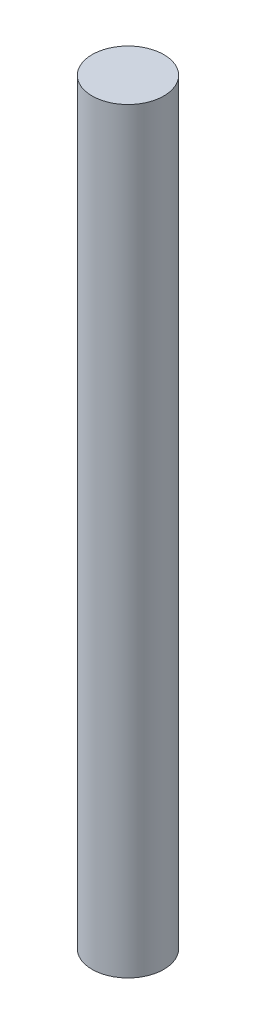
ISO-10303-21;
HEADER;
FILE_DESCRIPTION(('STEP AP214'),'2;1');
FILE_NAME('part.step','',(''),(''),'','','');
FILE_SCHEMA(('AUTOMOTIVE_DESIGN { 1 0 10303 214 1 1 1 1 }'));
ENDSEC;
DATA;
#1=APPLICATION_CONTEXT('core data for automotive mechanical design processes');
#2=APPLICATION_PROTOCOL_DEFINITION('international standard','automotive_design',2000,#1);
#3=PRODUCT_CONTEXT('',#1,'mechanical');
#4=PRODUCT('Part','Part','',(#3));
#5=PRODUCT_RELATED_PRODUCT_CATEGORY('part','',(#4));
#6=PRODUCT_DEFINITION_FORMATION('','',#4);
#7=PRODUCT_DEFINITION_CONTEXT('part definition',#1,'design');
#8=PRODUCT_DEFINITION('design','',#6,#7);
#9=PRODUCT_DEFINITION_SHAPE('','',#8);
#10=(LENGTH_UNIT() NAMED_UNIT(*) SI_UNIT(.MILLI.,.METRE.));
#11=(NAMED_UNIT(*) PLANE_ANGLE_UNIT() SI_UNIT($,.RADIAN.));
#12=(NAMED_UNIT(*) SI_UNIT($,.STERADIAN.) SOLID_ANGLE_UNIT());
#13=UNCERTAINTY_MEASURE_WITH_UNIT(LENGTH_MEASURE(1.E-05),#10,'distance_accuracy_value','');
#14=(GEOMETRIC_REPRESENTATION_CONTEXT(3) GLOBAL_UNCERTAINTY_ASSIGNED_CONTEXT((#13)) GLOBAL_UNIT_ASSIGNED_CONTEXT((#10,
#11,#12)) REPRESENTATION_CONTEXT('',''));
#15=CARTESIAN_POINT('',(0.,0.,0.));
#16=DIRECTION('',(0.,0.,1.));
#17=DIRECTION('',(1.,0.,0.));
#18=AXIS2_PLACEMENT_3D('',#15,#16,#17);
#19=CARTESIAN_POINT('',(0.,71.,0.));
#20=DIRECTION('',(0.,-1.,0.));
#21=DIRECTION('',(0.,0.,-1.));
#22=AXIS2_PLACEMENT_3D('',#19,#20,#21);
#23=CYLINDRICAL_SURFACE('',#22,3.3655);
#24=CARTESIAN_POINT('',(0.,71.,0.));
#25=DIRECTION('',(0.,1.,0.));
#26=DIRECTION('',(0.,0.,1.));
#27=AXIS2_PLACEMENT_3D('',#24,#25,#26);
#28=CIRCLE('',#27,3.3655);
#29=CARTESIAN_POINT('',(0.,71.,3.3655));
#30=VERTEX_POINT('',#29);
#31=EDGE_CURVE('E10',#30,#30,#28,.T.);
#32=ORIENTED_EDGE('',*,*,#31,.F.);
#33=EDGE_LOOP('',(#32));
#34=FACE_BOUND('',#33,.T.);
#35=CARTESIAN_POINT('',(0.,0.,0.));
#36=DIRECTION('',(0.,1.,0.));
#37=DIRECTION('',(0.,0.,1.));
#38=AXIS2_PLACEMENT_3D('',#35,#36,#37);
#39=CIRCLE('',#38,3.3655);
#40=CARTESIAN_POINT('',(0.,0.,3.3655));
#41=VERTEX_POINT('',#40);
#42=EDGE_CURVE('E35',#41,#41,#39,.T.);
#43=ORIENTED_EDGE('',*,*,#42,.T.);
#44=EDGE_LOOP('',(#43));
#45=FACE_BOUND('',#44,.T.);
#46=ADVANCED_FACE('F32',(#34,#45),#23,.T.);
#47=CARTESIAN_POINT('',(0.,71.,0.));
#48=DIRECTION('',(0.,1.,0.));
#49=DIRECTION('',(0.,0.,1.));
#50=AXIS2_PLACEMENT_3D('',#47,#48,#49);
#51=PLANE('',#50);
#52=ORIENTED_EDGE('',*,*,#31,.T.);
#53=EDGE_LOOP('',(#52));
#54=FACE_BOUND('',#53,.T.);
#55=ADVANCED_FACE('F47',(#54),#51,.T.);
#56=CARTESIAN_POINT('',(0.,0.,0.));
#57=DIRECTION('',(0.,1.,0.));
#58=DIRECTION('',(0.,0.,1.));
#59=AXIS2_PLACEMENT_3D('',#56,#57,#58);
#60=PLANE('',#59);
#61=ORIENTED_EDGE('',*,*,#42,.F.);
#62=EDGE_LOOP('',(#61));
#63=FACE_BOUND('',#62,.T.);
#64=ADVANCED_FACE('F45',(#63),#60,.F.);
#65=CLOSED_SHELL('',(#46,#55,#64));
#66=MANIFOLD_SOLID_BREP('B2',#65);
#67=ADVANCED_BREP_SHAPE_REPRESENTATION('',(#18,#66),#14);
#68=SHAPE_DEFINITION_REPRESENTATION(#9,#67);
ENDSEC;
END-ISO-10303-21;
